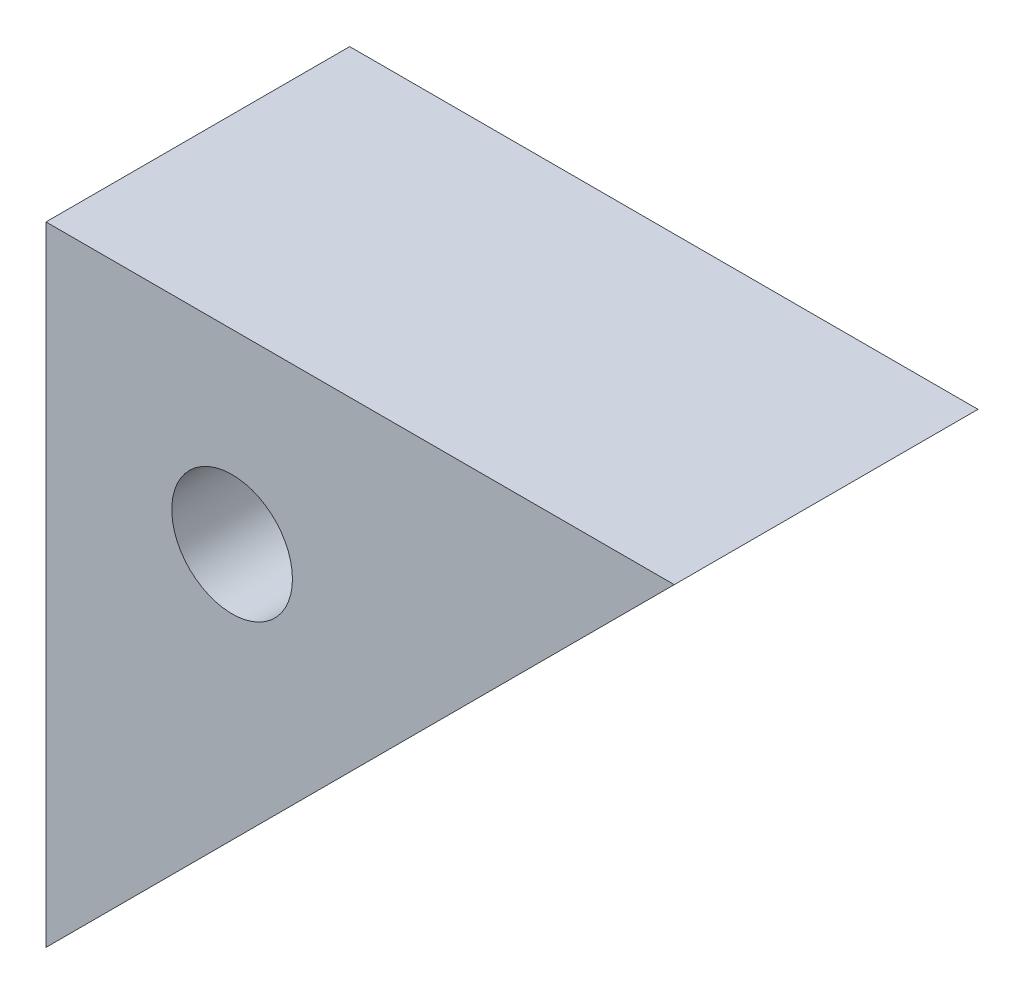
ISO-10303-21;
HEADER;
FILE_DESCRIPTION(('STEP AP214'),'2;1');
FILE_NAME('part.step','',(''),(''),'','','');
FILE_SCHEMA(('AUTOMOTIVE_DESIGN { 1 0 10303 214 1 1 1 1 }'));
ENDSEC;
DATA;
#1=APPLICATION_CONTEXT('core data for automotive mechanical design processes');
#2=APPLICATION_PROTOCOL_DEFINITION('international standard','automotive_design',2000,#1);
#3=PRODUCT_CONTEXT('',#1,'mechanical');
#4=PRODUCT('Part','Part','',(#3));
#5=PRODUCT_RELATED_PRODUCT_CATEGORY('part','',(#4));
#6=PRODUCT_DEFINITION_FORMATION('','',#4);
#7=PRODUCT_DEFINITION_CONTEXT('part definition',#1,'design');
#8=PRODUCT_DEFINITION('design','',#6,#7);
#9=PRODUCT_DEFINITION_SHAPE('','',#8);
#10=(LENGTH_UNIT() NAMED_UNIT(*) SI_UNIT(.MILLI.,.METRE.));
#11=(NAMED_UNIT(*) PLANE_ANGLE_UNIT() SI_UNIT($,.RADIAN.));
#12=(NAMED_UNIT(*) SI_UNIT($,.STERADIAN.) SOLID_ANGLE_UNIT());
#13=UNCERTAINTY_MEASURE_WITH_UNIT(LENGTH_MEASURE(1.E-05),#10,'distance_accuracy_value','');
#14=(GEOMETRIC_REPRESENTATION_CONTEXT(3) GLOBAL_UNCERTAINTY_ASSIGNED_CONTEXT((#13)) GLOBAL_UNIT_ASSIGNED_CONTEXT((#10,
#11,#12)) REPRESENTATION_CONTEXT('',''));
#15=CARTESIAN_POINT('',(0.,0.,0.));
#16=DIRECTION('',(0.,0.,1.));
#17=DIRECTION('',(1.,0.,0.));
#18=AXIS2_PLACEMENT_3D('',#15,#16,#17);
#19=CARTESIAN_POINT('',(0.,0.,0.));
#20=DIRECTION('',(0.,0.,-1.));
#21=DIRECTION('',(-1.,0.,0.));
#22=AXIS2_PLACEMENT_3D('',#19,#20,#21);
#23=PLANE('',#22);
#24=DIRECTION('',(0.,-1.,0.));
#25=VECTOR('',#24,1.);
#26=CARTESIAN_POINT('',(-33.2,56.7,0.));
#27=LINE('',#26,#25);
#28=CARTESIAN_POINT('',(-33.2,56.7,0.));
#29=VERTEX_POINT('',#28);
#30=CARTESIAN_POINT('',(-33.2,44.7,0.));
#31=VERTEX_POINT('',#30);
#32=EDGE_CURVE('E88',#29,#31,#27,.T.);
#33=ORIENTED_EDGE('',*,*,#32,.T.);
#34=DIRECTION('',(0.707106781186547,0.707106781186548,0.));
#35=VECTOR('',#34,1.);
#36=CARTESIAN_POINT('',(-33.2,44.7,0.));
#37=LINE('',#36,#35);
#38=CARTESIAN_POINT('',(-21.2,56.7,0.));
#39=VERTEX_POINT('',#38);
#40=EDGE_CURVE('E72',#31,#39,#37,.T.);
#41=ORIENTED_EDGE('',*,*,#40,.T.);
#42=DIRECTION('',(-1.,0.,0.));
#43=VECTOR('',#42,1.);
#44=CARTESIAN_POINT('',(-21.2,56.7,0.));
#45=LINE('',#44,#43);
#46=EDGE_CURVE('E79',#39,#29,#45,.T.);
#47=ORIENTED_EDGE('',*,*,#46,.T.);
#48=EDGE_LOOP('',(#33,#41,#47));
#49=FACE_BOUND('',#48,.T.);
#50=CARTESIAN_POINT('',(-29.6458476175971,53.1458476175971,0.));
#51=DIRECTION('',(0.,0.,1.));
#52=DIRECTION('',(1.,0.,0.));
#53=AXIS2_PLACEMENT_3D('',#50,#51,#52);
#54=CIRCLE('',#53,1.152550019);
#55=CARTESIAN_POINT('',(-28.4932975985971,53.1458476175971,0.));
#56=VERTEX_POINT('',#55);
#57=EDGE_CURVE('E115',#56,#56,#54,.T.);
#58=ORIENTED_EDGE('',*,*,#57,.F.);
#59=EDGE_LOOP('',(#58));
#60=FACE_BOUND('',#59,.T.);
#61=ADVANCED_FACE('F32',(#49,#60),#23,.F.);
#62=CARTESIAN_POINT('',(-33.2,56.7,-5.8));
#63=DIRECTION('',(-1.,0.,0.));
#64=DIRECTION('',(0.,0.,1.));
#65=AXIS2_PLACEMENT_3D('',#62,#63,#64);
#66=PLANE('',#65);
#67=ORIENTED_EDGE('',*,*,#32,.F.);
#68=DIRECTION('',(0.,0.,1.));
#69=VECTOR('',#68,1.);
#70=CARTESIAN_POINT('',(-33.2,56.7,-5.8));
#71=LINE('',#70,#69);
#72=CARTESIAN_POINT('',(-33.2,56.7,-5.8));
#73=VERTEX_POINT('',#72);
#74=EDGE_CURVE('E11',#73,#29,#71,.T.);
#75=ORIENTED_EDGE('',*,*,#74,.F.);
#76=DIRECTION('',(0.,-1.,0.));
#77=VECTOR('',#76,1.);
#78=CARTESIAN_POINT('',(-33.2,56.7,-5.8));
#79=LINE('',#78,#77);
#80=CARTESIAN_POINT('',(-33.2,44.7,-5.8));
#81=VERTEX_POINT('',#80);
#82=EDGE_CURVE('E77',#73,#81,#79,.T.);
#83=ORIENTED_EDGE('',*,*,#82,.T.);
#84=DIRECTION('',(0.,0.,1.));
#85=VECTOR('',#84,1.);
#86=CARTESIAN_POINT('',(-33.2,44.7,-5.8));
#87=LINE('',#86,#85);
#88=EDGE_CURVE('E36',#81,#31,#87,.T.);
#89=ORIENTED_EDGE('',*,*,#88,.T.);
#90=EDGE_LOOP('',(#67,#75,#83,#89));
#91=FACE_BOUND('',#90,.T.);
#92=ADVANCED_FACE('F34',(#91),#66,.T.);
#93=CARTESIAN_POINT('',(-21.2,56.7,-5.8));
#94=DIRECTION('',(0.,1.,0.));
#95=DIRECTION('',(0.,0.,1.));
#96=AXIS2_PLACEMENT_3D('',#93,#94,#95);
#97=PLANE('',#96);
#98=ORIENTED_EDGE('',*,*,#46,.F.);
#99=DIRECTION('',(0.,0.,1.));
#100=VECTOR('',#99,1.);
#101=CARTESIAN_POINT('',(-21.2,56.7,-5.8));
#102=LINE('',#101,#100);
#103=CARTESIAN_POINT('',(-21.2,56.7,-5.8));
#104=VERTEX_POINT('',#103);
#105=EDGE_CURVE('E42',#104,#39,#102,.T.);
#106=ORIENTED_EDGE('',*,*,#105,.F.);
#107=DIRECTION('',(-1.,0.,0.));
#108=VECTOR('',#107,1.);
#109=CARTESIAN_POINT('',(-21.2,56.7,-5.8));
#110=LINE('',#109,#108);
#111=EDGE_CURVE('E74',#104,#73,#110,.T.);
#112=ORIENTED_EDGE('',*,*,#111,.T.);
#113=ORIENTED_EDGE('',*,*,#74,.T.);
#114=EDGE_LOOP('',(#98,#106,#112,#113));
#115=FACE_BOUND('',#114,.T.);
#116=ADVANCED_FACE('F92',(#115),#97,.T.);
#117=CARTESIAN_POINT('',(-33.2,44.7,-5.8));
#118=DIRECTION('',(0.707106781186548,-0.707106781186547,0.));
#119=DIRECTION('',(0.707106781186547,0.707106781186548,0.));
#120=AXIS2_PLACEMENT_3D('',#117,#118,#119);
#121=PLANE('',#120);
#122=ORIENTED_EDGE('',*,*,#40,.F.);
#123=ORIENTED_EDGE('',*,*,#88,.F.);
#124=DIRECTION('',(0.707106781186547,0.707106781186548,0.));
#125=VECTOR('',#124,1.);
#126=CARTESIAN_POINT('',(-33.2,44.7,-5.8));
#127=LINE('',#126,#125);
#128=EDGE_CURVE('E70',#81,#104,#127,.T.);
#129=ORIENTED_EDGE('',*,*,#128,.T.);
#130=ORIENTED_EDGE('',*,*,#105,.T.);
#131=EDGE_LOOP('',(#122,#123,#129,#130));
#132=FACE_BOUND('',#131,.T.);
#133=ADVANCED_FACE('F69',(#132),#121,.T.);
#134=CARTESIAN_POINT('',(0.,0.,-5.8));
#135=DIRECTION('',(0.,0.,-1.));
#136=DIRECTION('',(-1.,0.,0.));
#137=AXIS2_PLACEMENT_3D('',#134,#135,#136);
#138=PLANE('',#137);
#139=CARTESIAN_POINT('',(-29.6458476175971,53.1458476175971,-5.8));
#140=DIRECTION('',(0.,0.,-1.));
#141=DIRECTION('',(-1.,0.,0.));
#142=AXIS2_PLACEMENT_3D('',#139,#140,#141);
#143=CIRCLE('',#142,1.152550019);
#144=CARTESIAN_POINT('',(-30.7983976365971,53.1458476175971,-5.8));
#145=VERTEX_POINT('',#144);
#146=EDGE_CURVE('E84',#145,#145,#143,.T.);
#147=ORIENTED_EDGE('',*,*,#146,.F.);
#148=EDGE_LOOP('',(#147));
#149=FACE_BOUND('',#148,.T.);
#150=ORIENTED_EDGE('',*,*,#82,.F.);
#151=ORIENTED_EDGE('',*,*,#111,.F.);
#152=ORIENTED_EDGE('',*,*,#128,.F.);
#153=EDGE_LOOP('',(#150,#151,#152));
#154=FACE_BOUND('',#153,.T.);
#155=ADVANCED_FACE('F76',(#149,#154),#138,.T.);
#156=CARTESIAN_POINT('',(-29.6458476175971,53.1458476175971,0.));
#157=DIRECTION('',(0.,0.,1.));
#158=DIRECTION('',(1.,0.,0.));
#159=AXIS2_PLACEMENT_3D('',#156,#157,#158);
#160=CYLINDRICAL_SURFACE('',#159,1.152550019);
#161=ORIENTED_EDGE('',*,*,#57,.T.);
#162=EDGE_LOOP('',(#161));
#163=FACE_BOUND('',#162,.T.);
#164=ORIENTED_EDGE('',*,*,#146,.T.);
#165=EDGE_LOOP('',(#164));
#166=FACE_BOUND('',#165,.T.);
#167=ADVANCED_FACE('F106',(#163,#166),#160,.F.);
#168=CLOSED_SHELL('',(#61,#92,#116,#133,#155,#167));
#169=MANIFOLD_SOLID_BREP('B2',#168);
#170=ADVANCED_BREP_SHAPE_REPRESENTATION('',(#18,#169),#14);
#171=SHAPE_DEFINITION_REPRESENTATION(#9,#170);
ENDSEC;
END-ISO-10303-21;
